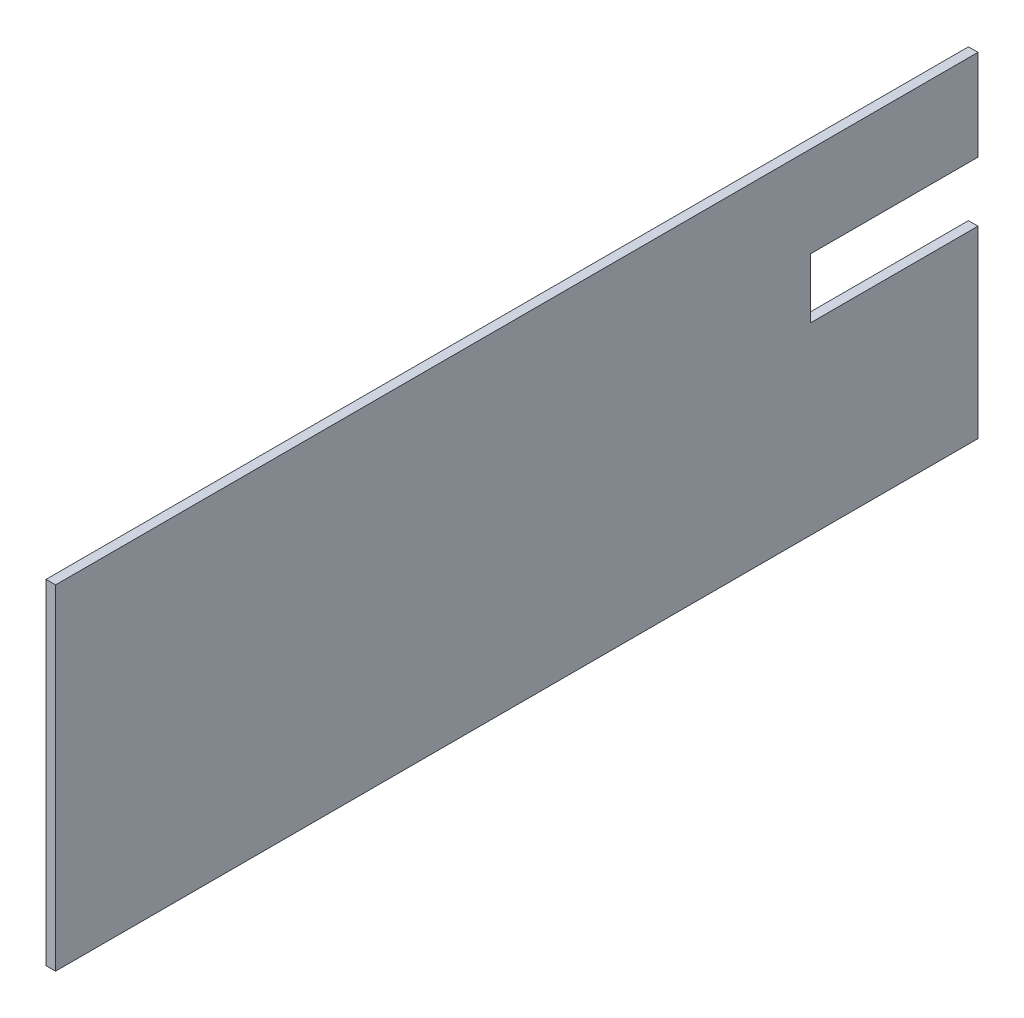
ISO-10303-21;
HEADER;
FILE_DESCRIPTION(('STEP AP214'),'2;1');
FILE_NAME('part.step','',(''),(''),'','','');
FILE_SCHEMA(('AUTOMOTIVE_DESIGN { 1 0 10303 214 1 1 1 1 }'));
ENDSEC;
DATA;
#1=APPLICATION_CONTEXT('core data for automotive mechanical design processes');
#2=APPLICATION_PROTOCOL_DEFINITION('international standard','automotive_design',2000,#1);
#3=PRODUCT_CONTEXT('',#1,'mechanical');
#4=PRODUCT('Part','Part','',(#3));
#5=PRODUCT_RELATED_PRODUCT_CATEGORY('part','',(#4));
#6=PRODUCT_DEFINITION_FORMATION('','',#4);
#7=PRODUCT_DEFINITION_CONTEXT('part definition',#1,'design');
#8=PRODUCT_DEFINITION('design','',#6,#7);
#9=PRODUCT_DEFINITION_SHAPE('','',#8);
#10=(LENGTH_UNIT() NAMED_UNIT(*) SI_UNIT(.MILLI.,.METRE.));
#11=(NAMED_UNIT(*) PLANE_ANGLE_UNIT() SI_UNIT($,.RADIAN.));
#12=(NAMED_UNIT(*) SI_UNIT($,.STERADIAN.) SOLID_ANGLE_UNIT());
#13=UNCERTAINTY_MEASURE_WITH_UNIT(LENGTH_MEASURE(1.E-05),#10,'distance_accuracy_value','');
#14=(GEOMETRIC_REPRESENTATION_CONTEXT(3) GLOBAL_UNCERTAINTY_ASSIGNED_CONTEXT((#13)) GLOBAL_UNIT_ASSIGNED_CONTEXT((#10,
#11,#12)) REPRESENTATION_CONTEXT('',''));
#15=CARTESIAN_POINT('',(0.,0.,0.));
#16=DIRECTION('',(0.,0.,1.));
#17=DIRECTION('',(1.,0.,0.));
#18=AXIS2_PLACEMENT_3D('',#15,#16,#17);
#19=CARTESIAN_POINT('',(35.,0.,-193.));
#20=DIRECTION('',(0.,0.,1.));
#21=DIRECTION('',(1.,0.,0.));
#22=AXIS2_PLACEMENT_3D('',#19,#20,#21);
#23=PLANE('',#22);
#24=DIRECTION('',(0.,1.,0.));
#25=VECTOR('',#24,1.);
#26=CARTESIAN_POINT('',(33.,70.,-193.));
#27=LINE('',#26,#25);
#28=CARTESIAN_POINT('',(33.,0.,-193.));
#29=VERTEX_POINT('',#28);
#30=CARTESIAN_POINT('',(33.,38.5,-193.));
#31=VERTEX_POINT('',#30);
#32=EDGE_CURVE('E156',#29,#31,#27,.T.);
#33=ORIENTED_EDGE('',*,*,#32,.T.);
#34=DIRECTION('',(1.,0.,0.));
#35=VECTOR('',#34,1.);
#36=CARTESIAN_POINT('',(25.,38.5,-193.));
#37=LINE('',#36,#35);
#38=CARTESIAN_POINT('',(35.,38.5,-193.));
#39=VERTEX_POINT('',#38);
#40=EDGE_CURVE('E149',#31,#39,#37,.T.);
#41=ORIENTED_EDGE('',*,*,#40,.T.);
#42=DIRECTION('',(0.,1.,0.));
#43=VECTOR('',#42,1.);
#44=CARTESIAN_POINT('',(35.,0.,-193.));
#45=LINE('',#44,#43);
#46=CARTESIAN_POINT('',(35.,0.,-193.));
#47=VERTEX_POINT('',#46);
#48=EDGE_CURVE('E122',#47,#39,#45,.T.);
#49=ORIENTED_EDGE('',*,*,#48,.F.);
#50=DIRECTION('',(-1.,0.,0.));
#51=VECTOR('',#50,1.);
#52=CARTESIAN_POINT('',(35.,0.,-193.));
#53=LINE('',#52,#51);
#54=EDGE_CURVE('E135',#47,#29,#53,.T.);
#55=ORIENTED_EDGE('',*,*,#54,.T.);
#56=EDGE_LOOP('',(#33,#41,#49,#55));
#57=FACE_BOUND('',#56,.T.);
#58=ADVANCED_FACE('F33',(#57),#23,.F.);
#59=CARTESIAN_POINT('',(35.,0.,0.));
#60=DIRECTION('',(0.,0.,-1.));
#61=DIRECTION('',(-1.,0.,0.));
#62=AXIS2_PLACEMENT_3D('',#59,#60,#61);
#63=PLANE('',#62);
#64=DIRECTION('',(-1.,0.,0.));
#65=VECTOR('',#64,1.);
#66=CARTESIAN_POINT('',(35.,70.,0.));
#67=LINE('',#66,#65);
#68=CARTESIAN_POINT('',(35.,70.,0.));
#69=VERTEX_POINT('',#68);
#70=CARTESIAN_POINT('',(33.,70.,0.));
#71=VERTEX_POINT('',#70);
#72=EDGE_CURVE('E131',#69,#71,#67,.T.);
#73=ORIENTED_EDGE('',*,*,#72,.T.);
#74=DIRECTION('',(0.,1.,0.));
#75=VECTOR('',#74,1.);
#76=CARTESIAN_POINT('',(33.,70.,0.));
#77=LINE('',#76,#75);
#78=CARTESIAN_POINT('',(33.,0.,0.));
#79=VERTEX_POINT('',#78);
#80=EDGE_CURVE('E56',#79,#71,#77,.T.);
#81=ORIENTED_EDGE('',*,*,#80,.F.);
#82=DIRECTION('',(-1.,0.,0.));
#83=VECTOR('',#82,1.);
#84=CARTESIAN_POINT('',(35.,0.,0.));
#85=LINE('',#84,#83);
#86=CARTESIAN_POINT('',(35.,0.,0.));
#87=VERTEX_POINT('',#86);
#88=EDGE_CURVE('E138',#87,#79,#85,.T.);
#89=ORIENTED_EDGE('',*,*,#88,.F.);
#90=DIRECTION('',(0.,-1.,0.));
#91=VECTOR('',#90,1.);
#92=CARTESIAN_POINT('',(35.,0.,0.));
#93=LINE('',#92,#91);
#94=EDGE_CURVE('E126',#69,#87,#93,.T.);
#95=ORIENTED_EDGE('',*,*,#94,.F.);
#96=EDGE_LOOP('',(#73,#81,#89,#95));
#97=FACE_BOUND('',#96,.T.);
#98=ADVANCED_FACE('F35',(#97),#63,.F.);
#99=CARTESIAN_POINT('',(35.,0.,0.));
#100=DIRECTION('',(0.,1.,0.));
#101=DIRECTION('',(0.,0.,1.));
#102=AXIS2_PLACEMENT_3D('',#99,#100,#101);
#103=PLANE('',#102);
#104=ORIENTED_EDGE('',*,*,#88,.T.);
#105=DIRECTION('',(0.,0.,1.));
#106=VECTOR('',#105,1.);
#107=CARTESIAN_POINT('',(33.,0.,-193.));
#108=LINE('',#107,#106);
#109=EDGE_CURVE('E158',#29,#79,#108,.T.);
#110=ORIENTED_EDGE('',*,*,#109,.F.);
#111=ORIENTED_EDGE('',*,*,#54,.F.);
#112=DIRECTION('',(0.,0.,-1.));
#113=VECTOR('',#112,1.);
#114=CARTESIAN_POINT('',(35.,0.,0.));
#115=LINE('',#114,#113);
#116=EDGE_CURVE('E123',#87,#47,#115,.T.);
#117=ORIENTED_EDGE('',*,*,#116,.F.);
#118=EDGE_LOOP('',(#104,#110,#111,#117));
#119=FACE_BOUND('',#118,.T.);
#120=ADVANCED_FACE('F171',(#119),#103,.F.);
#121=CARTESIAN_POINT('',(35.,51.,-193.));
#122=VERTEX_POINT('',#121);
#123=CARTESIAN_POINT('',(35.,70.,-193.));
#124=VERTEX_POINT('',#123);
#125=EDGE_CURVE('E112',#122,#124,#45,.T.);
#126=ORIENTED_EDGE('',*,*,#125,.F.);
#127=DIRECTION('',(1.,0.,0.));
#128=VECTOR('',#127,1.);
#129=CARTESIAN_POINT('',(25.,51.,-193.));
#130=LINE('',#129,#128);
#131=CARTESIAN_POINT('',(33.,51.,-193.));
#132=VERTEX_POINT('',#131);
#133=EDGE_CURVE('E97',#132,#122,#130,.T.);
#134=ORIENTED_EDGE('',*,*,#133,.F.);
#135=CARTESIAN_POINT('',(33.,70.,-193.));
#136=VERTEX_POINT('',#135);
#137=EDGE_CURVE('E159',#132,#136,#27,.T.);
#138=ORIENTED_EDGE('',*,*,#137,.T.);
#139=DIRECTION('',(-1.,0.,0.));
#140=VECTOR('',#139,1.);
#141=CARTESIAN_POINT('',(35.,70.,-193.));
#142=LINE('',#141,#140);
#143=EDGE_CURVE('E120',#124,#136,#142,.T.);
#144=ORIENTED_EDGE('',*,*,#143,.F.);
#145=EDGE_LOOP('',(#126,#134,#138,#144));
#146=FACE_BOUND('',#145,.T.);
#147=ADVANCED_FACE('F118',(#146),#23,.F.);
#148=CARTESIAN_POINT('',(35.,70.,0.));
#149=DIRECTION('',(0.,-1.,0.));
#150=DIRECTION('',(0.,0.,-1.));
#151=AXIS2_PLACEMENT_3D('',#148,#149,#150);
#152=PLANE('',#151);
#153=ORIENTED_EDGE('',*,*,#143,.T.);
#154=DIRECTION('',(0.,0.,1.));
#155=VECTOR('',#154,1.);
#156=CARTESIAN_POINT('',(33.,70.,-193.));
#157=LINE('',#156,#155);
#158=EDGE_CURVE('E161',#136,#71,#157,.T.);
#159=ORIENTED_EDGE('',*,*,#158,.T.);
#160=ORIENTED_EDGE('',*,*,#72,.F.);
#161=DIRECTION('',(0.,0.,1.));
#162=VECTOR('',#161,1.);
#163=CARTESIAN_POINT('',(35.,70.,0.));
#164=LINE('',#163,#162);
#165=EDGE_CURVE('E125',#124,#69,#164,.T.);
#166=ORIENTED_EDGE('',*,*,#165,.F.);
#167=EDGE_LOOP('',(#153,#159,#160,#166));
#168=FACE_BOUND('',#167,.T.);
#169=ADVANCED_FACE('F193',(#168),#152,.F.);
#170=CARTESIAN_POINT('',(35.,0.,0.));
#171=DIRECTION('',(-1.,0.,0.));
#172=DIRECTION('',(0.,0.,1.));
#173=AXIS2_PLACEMENT_3D('',#170,#171,#172);
#174=PLANE('',#173);
#175=ORIENTED_EDGE('',*,*,#48,.T.);
#176=DIRECTION('',(0.,0.,-1.));
#177=VECTOR('',#176,1.);
#178=CARTESIAN_POINT('',(35.,38.5,-193.));
#179=LINE('',#178,#177);
#180=CARTESIAN_POINT('',(35.,38.5,-158.));
#181=VERTEX_POINT('',#180);
#182=EDGE_CURVE('E107',#181,#39,#179,.T.);
#183=ORIENTED_EDGE('',*,*,#182,.F.);
#184=DIRECTION('',(0.,-1.,0.));
#185=VECTOR('',#184,1.);
#186=CARTESIAN_POINT('',(35.,51.,-158.));
#187=LINE('',#186,#185);
#188=CARTESIAN_POINT('',(35.,51.,-158.));
#189=VERTEX_POINT('',#188);
#190=EDGE_CURVE('E116',#189,#181,#187,.T.);
#191=ORIENTED_EDGE('',*,*,#190,.F.);
#192=DIRECTION('',(0.,0.,1.));
#193=VECTOR('',#192,1.);
#194=CARTESIAN_POINT('',(35.,51.,-193.));
#195=LINE('',#194,#193);
#196=EDGE_CURVE('E100',#122,#189,#195,.T.);
#197=ORIENTED_EDGE('',*,*,#196,.F.);
#198=ORIENTED_EDGE('',*,*,#125,.T.);
#199=ORIENTED_EDGE('',*,*,#165,.T.);
#200=ORIENTED_EDGE('',*,*,#94,.T.);
#201=ORIENTED_EDGE('',*,*,#116,.T.);
#202=EDGE_LOOP('',(#175,#183,#191,#197,#198,#199,#200,#201));
#203=FACE_BOUND('',#202,.T.);
#204=ADVANCED_FACE('F111',(#203),#174,.F.);
#205=CARTESIAN_POINT('',(33.,70.,-193.));
#206=DIRECTION('',(1.,0.,0.));
#207=DIRECTION('',(0.,1.,0.));
#208=AXIS2_PLACEMENT_3D('',#205,#206,#207);
#209=PLANE('',#208);
#210=DIRECTION('',(0.,-1.,0.));
#211=VECTOR('',#210,1.);
#212=CARTESIAN_POINT('',(33.,70.,-158.));
#213=LINE('',#212,#211);
#214=CARTESIAN_POINT('',(33.,51.,-158.));
#215=VERTEX_POINT('',#214);
#216=CARTESIAN_POINT('',(33.,38.5,-158.));
#217=VERTEX_POINT('',#216);
#218=EDGE_CURVE('E41',#215,#217,#213,.T.);
#219=ORIENTED_EDGE('',*,*,#218,.T.);
#220=DIRECTION('',(0.,0.,-1.));
#221=VECTOR('',#220,1.);
#222=CARTESIAN_POINT('',(33.,38.5,-193.));
#223=LINE('',#222,#221);
#224=EDGE_CURVE('E11',#217,#31,#223,.T.);
#225=ORIENTED_EDGE('',*,*,#224,.T.);
#226=ORIENTED_EDGE('',*,*,#32,.F.);
#227=ORIENTED_EDGE('',*,*,#109,.T.);
#228=ORIENTED_EDGE('',*,*,#80,.T.);
#229=ORIENTED_EDGE('',*,*,#158,.F.);
#230=ORIENTED_EDGE('',*,*,#137,.F.);
#231=DIRECTION('',(0.,0.,1.));
#232=VECTOR('',#231,1.);
#233=CARTESIAN_POINT('',(33.,51.,-193.));
#234=LINE('',#233,#232);
#235=EDGE_CURVE('E103',#132,#215,#234,.T.);
#236=ORIENTED_EDGE('',*,*,#235,.T.);
#237=EDGE_LOOP('',(#219,#225,#226,#227,#228,#229,#230,#236));
#238=FACE_BOUND('',#237,.T.);
#239=ADVANCED_FACE('F142',(#238),#209,.F.);
#240=CARTESIAN_POINT('',(25.,38.5,-193.));
#241=DIRECTION('',(0.,-1.,0.));
#242=DIRECTION('',(0.,0.,-1.));
#243=AXIS2_PLACEMENT_3D('',#240,#241,#242);
#244=PLANE('',#243);
#245=DIRECTION('',(1.,0.,0.));
#246=VECTOR('',#245,1.);
#247=CARTESIAN_POINT('',(25.,38.5,-158.));
#248=LINE('',#247,#246);
#249=EDGE_CURVE('E147',#217,#181,#248,.T.);
#250=ORIENTED_EDGE('',*,*,#249,.T.);
#251=ORIENTED_EDGE('',*,*,#182,.T.);
#252=ORIENTED_EDGE('',*,*,#40,.F.);
#253=ORIENTED_EDGE('',*,*,#224,.F.);
#254=EDGE_LOOP('',(#250,#251,#252,#253));
#255=FACE_BOUND('',#254,.T.);
#256=ADVANCED_FACE('F175',(#255),#244,.F.);
#257=CARTESIAN_POINT('',(25.,51.,-158.));
#258=DIRECTION('',(0.,0.,1.));
#259=DIRECTION('',(1.,0.,0.));
#260=AXIS2_PLACEMENT_3D('',#257,#258,#259);
#261=PLANE('',#260);
#262=DIRECTION('',(1.,0.,0.));
#263=VECTOR('',#262,1.);
#264=CARTESIAN_POINT('',(25.,51.,-158.));
#265=LINE('',#264,#263);
#266=EDGE_CURVE('E48',#215,#189,#265,.T.);
#267=ORIENTED_EDGE('',*,*,#266,.T.);
#268=ORIENTED_EDGE('',*,*,#190,.T.);
#269=ORIENTED_EDGE('',*,*,#249,.F.);
#270=ORIENTED_EDGE('',*,*,#218,.F.);
#271=EDGE_LOOP('',(#267,#268,#269,#270));
#272=FACE_BOUND('',#271,.T.);
#273=ADVANCED_FACE('F146',(#272),#261,.F.);
#274=CARTESIAN_POINT('',(25.,51.,-193.));
#275=DIRECTION('',(0.,1.,0.));
#276=DIRECTION('',(0.,0.,1.));
#277=AXIS2_PLACEMENT_3D('',#274,#275,#276);
#278=PLANE('',#277);
#279=ORIENTED_EDGE('',*,*,#133,.T.);
#280=ORIENTED_EDGE('',*,*,#196,.T.);
#281=ORIENTED_EDGE('',*,*,#266,.F.);
#282=ORIENTED_EDGE('',*,*,#235,.F.);
#283=EDGE_LOOP('',(#279,#280,#281,#282));
#284=FACE_BOUND('',#283,.T.);
#285=ADVANCED_FACE('F99',(#284),#278,.F.);
#286=CLOSED_SHELL('',(#58,#98,#120,#147,#169,#204,#239,#256,#273,#285));
#287=MANIFOLD_SOLID_BREP('B2',#286);
#288=ADVANCED_BREP_SHAPE_REPRESENTATION('',(#18,#287),#14);
#289=SHAPE_DEFINITION_REPRESENTATION(#9,#288);
ENDSEC;
END-ISO-10303-21;
